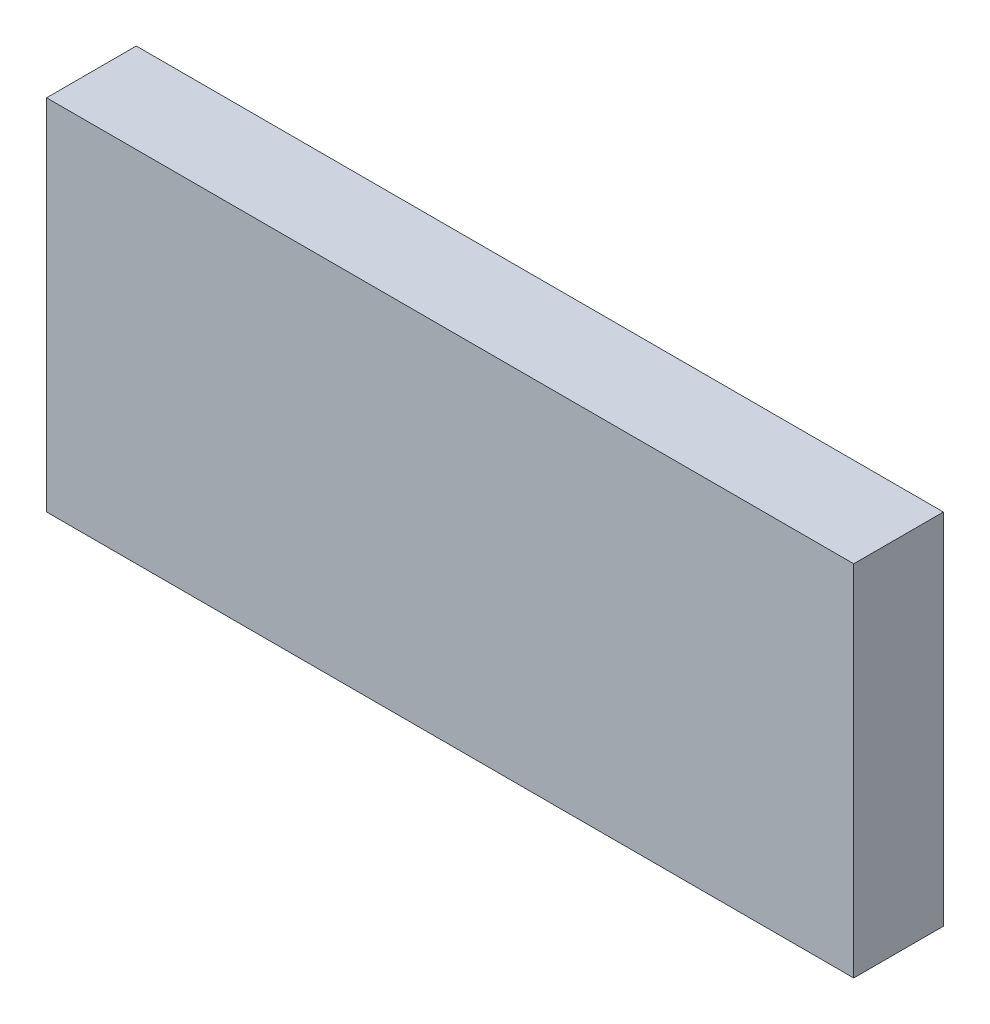
ISO-10303-21;
HEADER;
FILE_DESCRIPTION(('STEP AP214'),'2;1');
FILE_NAME('part.step','',(''),(''),'','','');
FILE_SCHEMA(('AUTOMOTIVE_DESIGN { 1 0 10303 214 1 1 1 1 }'));
ENDSEC;
DATA;
#1=APPLICATION_CONTEXT('core data for automotive mechanical design processes');
#2=APPLICATION_PROTOCOL_DEFINITION('international standard','automotive_design',2000,#1);
#3=PRODUCT_CONTEXT('',#1,'mechanical');
#4=PRODUCT('Part','Part','',(#3));
#5=PRODUCT_RELATED_PRODUCT_CATEGORY('part','',(#4));
#6=PRODUCT_DEFINITION_FORMATION('','',#4);
#7=PRODUCT_DEFINITION_CONTEXT('part definition',#1,'design');
#8=PRODUCT_DEFINITION('design','',#6,#7);
#9=PRODUCT_DEFINITION_SHAPE('','',#8);
#10=(LENGTH_UNIT() NAMED_UNIT(*) SI_UNIT(.MILLI.,.METRE.));
#11=(NAMED_UNIT(*) PLANE_ANGLE_UNIT() SI_UNIT($,.RADIAN.));
#12=(NAMED_UNIT(*) SI_UNIT($,.STERADIAN.) SOLID_ANGLE_UNIT());
#13=UNCERTAINTY_MEASURE_WITH_UNIT(LENGTH_MEASURE(1.E-05),#10,'distance_accuracy_value','');
#14=(GEOMETRIC_REPRESENTATION_CONTEXT(3) GLOBAL_UNCERTAINTY_ASSIGNED_CONTEXT((#13)) GLOBAL_UNIT_ASSIGNED_CONTEXT((#10,
#11,#12)) REPRESENTATION_CONTEXT('',''));
#15=CARTESIAN_POINT('',(0.,0.,0.));
#16=DIRECTION('',(0.,0.,1.));
#17=DIRECTION('',(1.,0.,0.));
#18=AXIS2_PLACEMENT_3D('',#15,#16,#17);
#19=CARTESIAN_POINT('',(0.,0.,2.54));
#20=DIRECTION('',(-1.,0.,0.));
#21=DIRECTION('',(0.,0.,1.));
#22=AXIS2_PLACEMENT_3D('',#19,#20,#21);
#23=PLANE('',#22);
#24=DIRECTION('',(0.,1.,0.));
#25=VECTOR('',#24,1.);
#26=CARTESIAN_POINT('',(0.,0.,0.));
#27=LINE('',#26,#25);
#28=CARTESIAN_POINT('',(0.,0.,0.));
#29=VERTEX_POINT('',#28);
#30=CARTESIAN_POINT('',(0.,10.16,0.));
#31=VERTEX_POINT('',#30);
#32=EDGE_CURVE('E120',#29,#31,#27,.T.);
#33=ORIENTED_EDGE('',*,*,#32,.F.);
#34=DIRECTION('',(0.,0.,-1.));
#35=VECTOR('',#34,1.);
#36=CARTESIAN_POINT('',(0.,0.,2.54));
#37=LINE('',#36,#35);
#38=CARTESIAN_POINT('',(0.,0.,2.54));
#39=VERTEX_POINT('',#38);
#40=EDGE_CURVE('E11',#39,#29,#37,.T.);
#41=ORIENTED_EDGE('',*,*,#40,.F.);
#42=DIRECTION('',(0.,1.,0.));
#43=VECTOR('',#42,1.);
#44=CARTESIAN_POINT('',(0.,0.,2.54));
#45=LINE('',#44,#43);
#46=CARTESIAN_POINT('',(0.,10.16,2.54));
#47=VERTEX_POINT('',#46);
#48=EDGE_CURVE('E113',#39,#47,#45,.T.);
#49=ORIENTED_EDGE('',*,*,#48,.T.);
#50=DIRECTION('',(0.,0.,-1.));
#51=VECTOR('',#50,1.);
#52=CARTESIAN_POINT('',(0.,10.16,2.54));
#53=LINE('',#52,#51);
#54=EDGE_CURVE('E52',#47,#31,#53,.T.);
#55=ORIENTED_EDGE('',*,*,#54,.T.);
#56=EDGE_LOOP('',(#33,#41,#49,#55));
#57=FACE_BOUND('',#56,.T.);
#58=ADVANCED_FACE('F49',(#57),#23,.T.);
#59=CARTESIAN_POINT('',(0.,0.,2.54));
#60=DIRECTION('',(0.,1.,0.));
#61=DIRECTION('',(0.,0.,1.));
#62=AXIS2_PLACEMENT_3D('',#59,#60,#61);
#63=PLANE('',#62);
#64=DIRECTION('',(1.,0.,0.));
#65=VECTOR('',#64,1.);
#66=CARTESIAN_POINT('',(0.,0.,0.));
#67=LINE('',#66,#65);
#68=CARTESIAN_POINT('',(22.86,0.,0.));
#69=VERTEX_POINT('',#68);
#70=EDGE_CURVE('E83',#29,#69,#67,.T.);
#71=ORIENTED_EDGE('',*,*,#70,.T.);
#72=DIRECTION('',(0.,0.,-1.));
#73=VECTOR('',#72,1.);
#74=CARTESIAN_POINT('',(22.86,0.,2.54));
#75=LINE('',#74,#73);
#76=CARTESIAN_POINT('',(22.86,0.,2.54));
#77=VERTEX_POINT('',#76);
#78=EDGE_CURVE('E59',#77,#69,#75,.T.);
#79=ORIENTED_EDGE('',*,*,#78,.F.);
#80=DIRECTION('',(1.,0.,0.));
#81=VECTOR('',#80,1.);
#82=CARTESIAN_POINT('',(0.,0.,2.54));
#83=LINE('',#82,#81);
#84=EDGE_CURVE('E100',#39,#77,#83,.T.);
#85=ORIENTED_EDGE('',*,*,#84,.F.);
#86=ORIENTED_EDGE('',*,*,#40,.T.);
#87=EDGE_LOOP('',(#71,#79,#85,#86));
#88=FACE_BOUND('',#87,.T.);
#89=ADVANCED_FACE('F136',(#88),#63,.F.);
#90=CARTESIAN_POINT('',(22.86,0.,2.54));
#91=DIRECTION('',(-1.,0.,0.));
#92=DIRECTION('',(0.,0.,1.));
#93=AXIS2_PLACEMENT_3D('',#90,#91,#92);
#94=PLANE('',#93);
#95=DIRECTION('',(0.,1.,0.));
#96=VECTOR('',#95,1.);
#97=CARTESIAN_POINT('',(22.86,0.,0.));
#98=LINE('',#97,#96);
#99=CARTESIAN_POINT('',(22.86,10.16,0.));
#100=VERTEX_POINT('',#99);
#101=EDGE_CURVE('E108',#69,#100,#98,.T.);
#102=ORIENTED_EDGE('',*,*,#101,.T.);
#103=DIRECTION('',(0.,0.,-1.));
#104=VECTOR('',#103,1.);
#105=CARTESIAN_POINT('',(22.86,10.16,2.54));
#106=LINE('',#105,#104);
#107=CARTESIAN_POINT('',(22.86,10.16,2.54));
#108=VERTEX_POINT('',#107);
#109=EDGE_CURVE('E105',#108,#100,#106,.T.);
#110=ORIENTED_EDGE('',*,*,#109,.F.);
#111=DIRECTION('',(0.,1.,0.));
#112=VECTOR('',#111,1.);
#113=CARTESIAN_POINT('',(22.86,0.,2.54));
#114=LINE('',#113,#112);
#115=EDGE_CURVE('E95',#77,#108,#114,.T.);
#116=ORIENTED_EDGE('',*,*,#115,.F.);
#117=ORIENTED_EDGE('',*,*,#78,.T.);
#118=EDGE_LOOP('',(#102,#110,#116,#117));
#119=FACE_BOUND('',#118,.T.);
#120=ADVANCED_FACE('F106',(#119),#94,.F.);
#121=CARTESIAN_POINT('',(0.,10.16,2.54));
#122=DIRECTION('',(0.,1.,0.));
#123=DIRECTION('',(0.,0.,1.));
#124=AXIS2_PLACEMENT_3D('',#121,#122,#123);
#125=PLANE('',#124);
#126=DIRECTION('',(1.,0.,0.));
#127=VECTOR('',#126,1.);
#128=CARTESIAN_POINT('',(0.,10.16,0.));
#129=LINE('',#128,#127);
#130=EDGE_CURVE('E124',#31,#100,#129,.T.);
#131=ORIENTED_EDGE('',*,*,#130,.F.);
#132=ORIENTED_EDGE('',*,*,#54,.F.);
#133=DIRECTION('',(1.,0.,0.));
#134=VECTOR('',#133,1.);
#135=CARTESIAN_POINT('',(0.,10.16,2.54));
#136=LINE('',#135,#134);
#137=EDGE_CURVE('E99',#47,#108,#136,.T.);
#138=ORIENTED_EDGE('',*,*,#137,.T.);
#139=ORIENTED_EDGE('',*,*,#109,.T.);
#140=EDGE_LOOP('',(#131,#132,#138,#139));
#141=FACE_BOUND('',#140,.T.);
#142=ADVANCED_FACE('F111',(#141),#125,.T.);
#143=CARTESIAN_POINT('',(0.,0.,2.54));
#144=DIRECTION('',(0.,0.,-1.));
#145=DIRECTION('',(-1.,0.,0.));
#146=AXIS2_PLACEMENT_3D('',#143,#144,#145);
#147=PLANE('',#146);
#148=ORIENTED_EDGE('',*,*,#48,.F.);
#149=ORIENTED_EDGE('',*,*,#84,.T.);
#150=ORIENTED_EDGE('',*,*,#115,.T.);
#151=ORIENTED_EDGE('',*,*,#137,.F.);
#152=EDGE_LOOP('',(#148,#149,#150,#151));
#153=FACE_BOUND('',#152,.T.);
#154=ADVANCED_FACE('F98',(#153),#147,.F.);
#155=CARTESIAN_POINT('',(0.,0.,0.));
#156=DIRECTION('',(0.,0.,-1.));
#157=DIRECTION('',(-1.,0.,0.));
#158=AXIS2_PLACEMENT_3D('',#155,#156,#157);
#159=PLANE('',#158);
#160=ORIENTED_EDGE('',*,*,#32,.T.);
#161=ORIENTED_EDGE('',*,*,#130,.T.);
#162=ORIENTED_EDGE('',*,*,#101,.F.);
#163=ORIENTED_EDGE('',*,*,#70,.F.);
#164=EDGE_LOOP('',(#160,#161,#162,#163));
#165=FACE_BOUND('',#164,.T.);
#166=ADVANCED_FACE('F133',(#165),#159,.T.);
#167=CLOSED_SHELL('',(#58,#89,#120,#142,#154,#166));
#168=MANIFOLD_SOLID_BREP('B2',#167);
#169=ADVANCED_BREP_SHAPE_REPRESENTATION('',(#18,#168),#14);
#170=SHAPE_DEFINITION_REPRESENTATION(#9,#169);
ENDSEC;
END-ISO-10303-21;
